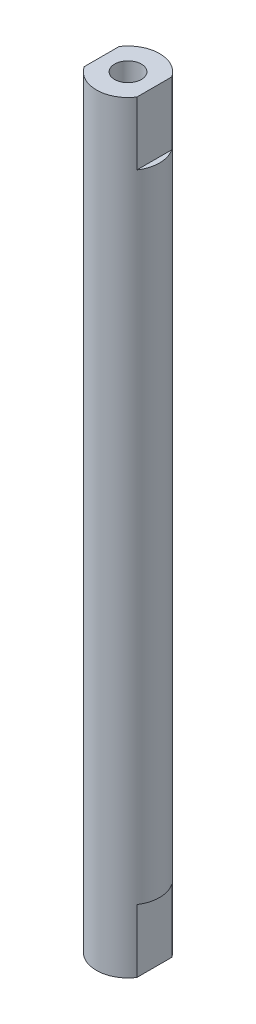
ISO-10303-21;
HEADER;
FILE_DESCRIPTION(('STEP AP214'),'2;1');
FILE_NAME('part.step','',(''),(''),'','','');
FILE_SCHEMA(('AUTOMOTIVE_DESIGN { 1 0 10303 214 1 1 1 1 }'));
ENDSEC;
DATA;
#1=APPLICATION_CONTEXT('core data for automotive mechanical design processes');
#2=APPLICATION_PROTOCOL_DEFINITION('international standard','automotive_design',2000,#1);
#3=PRODUCT_CONTEXT('',#1,'mechanical');
#4=PRODUCT('Part','Part','',(#3));
#5=PRODUCT_RELATED_PRODUCT_CATEGORY('part','',(#4));
#6=PRODUCT_DEFINITION_FORMATION('','',#4);
#7=PRODUCT_DEFINITION_CONTEXT('part definition',#1,'design');
#8=PRODUCT_DEFINITION('design','',#6,#7);
#9=PRODUCT_DEFINITION_SHAPE('','',#8);
#10=(LENGTH_UNIT() NAMED_UNIT(*) SI_UNIT(.MILLI.,.METRE.));
#11=(NAMED_UNIT(*) PLANE_ANGLE_UNIT() SI_UNIT($,.RADIAN.));
#12=(NAMED_UNIT(*) SI_UNIT($,.STERADIAN.) SOLID_ANGLE_UNIT());
#13=UNCERTAINTY_MEASURE_WITH_UNIT(LENGTH_MEASURE(1.E-05),#10,'distance_accuracy_value','');
#14=(GEOMETRIC_REPRESENTATION_CONTEXT(3) GLOBAL_UNCERTAINTY_ASSIGNED_CONTEXT((#13)) GLOBAL_UNIT_ASSIGNED_CONTEXT((#10,
#11,#12)) REPRESENTATION_CONTEXT('',''));
#15=CARTESIAN_POINT('',(0.,0.,0.));
#16=DIRECTION('',(0.,0.,1.));
#17=DIRECTION('',(1.,0.,0.));
#18=AXIS2_PLACEMENT_3D('',#15,#16,#17);
#19=CARTESIAN_POINT('',(0.,57.5,0.));
#20=DIRECTION('',(0.,1.,0.));
#21=DIRECTION('',(-1.,0.,0.));
#22=AXIS2_PLACEMENT_3D('',#19,#20,#21);
#23=PLANE('',#22);
#24=CARTESIAN_POINT('',(1.5809644186773E-13,57.5,0.));
#25=DIRECTION('',(0.,1.,0.));
#26=DIRECTION('',(0.,0.,1.));
#27=AXIS2_PLACEMENT_3D('',#24,#25,#26);
#28=CIRCLE('',#27,2.01929999999999);
#29=CARTESIAN_POINT('',(1.5809644186773E-13,57.5,2.01929999999999));
#30=VERTEX_POINT('',#29);
#31=EDGE_CURVE('E122',#30,#30,#28,.T.);
#32=ORIENTED_EDGE('',*,*,#31,.F.);
#33=EDGE_LOOP('',(#32));
#34=FACE_BOUND('',#33,.T.);
#35=DIRECTION('',(0.,0.,1.));
#36=VECTOR('',#35,1.);
#37=CARTESIAN_POINT('',(3.96875000000008,57.5,2.63257092734472));
#38=LINE('',#37,#36);
#39=CARTESIAN_POINT('',(3.96875000000008,57.5,-2.63257092734472));
#40=VERTEX_POINT('',#39);
#41=CARTESIAN_POINT('',(3.96875000000008,57.5,2.63257092734472));
#42=VERTEX_POINT('',#41);
#43=EDGE_CURVE('E141',#40,#42,#38,.T.);
#44=ORIENTED_EDGE('',*,*,#43,.F.);
#45=CARTESIAN_POINT('',(1.5809644186773E-13,57.5,0.));
#46=DIRECTION('',(0.,-1.,0.));
#47=DIRECTION('',(1.,0.,0.));
#48=AXIS2_PLACEMENT_3D('',#45,#46,#47);
#49=CIRCLE('',#48,4.76250000000014);
#50=CARTESIAN_POINT('',(-3.96874999999992,57.5,-2.63257092734472));
#51=VERTEX_POINT('',#50);
#52=EDGE_CURVE('E50',#51,#40,#49,.T.);
#53=ORIENTED_EDGE('',*,*,#52,.F.);
#54=DIRECTION('',(0.,0.,-1.));
#55=VECTOR('',#54,1.);
#56=CARTESIAN_POINT('',(-3.96874999999992,57.5,2.63257092734472));
#57=LINE('',#56,#55);
#58=CARTESIAN_POINT('',(-3.96874999999992,57.5,2.63257092734472));
#59=VERTEX_POINT('',#58);
#60=EDGE_CURVE('E137',#59,#51,#57,.T.);
#61=ORIENTED_EDGE('',*,*,#60,.F.);
#62=EDGE_CURVE('E11',#42,#59,#49,.T.);
#63=ORIENTED_EDGE('',*,*,#62,.F.);
#64=EDGE_LOOP('',(#44,#53,#61,#63));
#65=FACE_BOUND('',#64,.T.);
#66=ADVANCED_FACE('F42',(#34,#65),#23,.T.);
#67=CARTESIAN_POINT('',(0.,-57.5,0.));
#68=DIRECTION('',(0.,-1.,0.));
#69=DIRECTION('',(1.,0.,0.));
#70=AXIS2_PLACEMENT_3D('',#67,#68,#69);
#71=CYLINDRICAL_SURFACE('',#70,4.76250000000007);
#72=ORIENTED_EDGE('',*,*,#52,.T.);
#73=DIRECTION('',(0.,1.,0.));
#74=VECTOR('',#73,1.);
#75=CARTESIAN_POINT('',(3.96875000000008,47.975,-2.63257092734472));
#76=LINE('',#75,#74);
#77=CARTESIAN_POINT('',(3.96875000000008,47.975,-2.63257092734472));
#78=VERTEX_POINT('',#77);
#79=EDGE_CURVE('E144',#78,#40,#76,.T.);
#80=ORIENTED_EDGE('',*,*,#79,.F.);
#81=CARTESIAN_POINT('',(0.,47.975,0.));
#82=DIRECTION('',(0.,1.,0.));
#83=DIRECTION('',(0.,0.,-1.));
#84=AXIS2_PLACEMENT_3D('',#81,#82,#83);
#85=CIRCLE('',#84,4.76250000000007);
#86=CARTESIAN_POINT('',(3.96875000000013,47.975,2.63257092734475));
#87=VERTEX_POINT('',#86);
#88=EDGE_CURVE('E138',#87,#78,#85,.T.);
#89=ORIENTED_EDGE('',*,*,#88,.F.);
#90=DIRECTION('',(0.,1.,0.));
#91=VECTOR('',#90,1.);
#92=CARTESIAN_POINT('',(3.96875000000008,47.975,2.63257092734472));
#93=LINE('',#92,#91);
#94=EDGE_CURVE('E148',#87,#42,#93,.T.);
#95=ORIENTED_EDGE('',*,*,#94,.T.);
#96=ORIENTED_EDGE('',*,*,#62,.T.);
#97=DIRECTION('',(0.,1.,0.));
#98=VECTOR('',#97,1.);
#99=CARTESIAN_POINT('',(-3.96874999999992,47.975,2.63257092734472));
#100=LINE('',#99,#98);
#101=CARTESIAN_POINT('',(-3.96874999999992,47.975,2.63257092734472));
#102=VERTEX_POINT('',#101);
#103=EDGE_CURVE('E160',#102,#59,#100,.T.);
#104=ORIENTED_EDGE('',*,*,#103,.F.);
#105=CARTESIAN_POINT('',(0.,47.975,0.));
#106=DIRECTION('',(0.,1.,0.));
#107=DIRECTION('',(0.,0.,1.));
#108=AXIS2_PLACEMENT_3D('',#105,#106,#107);
#109=CIRCLE('',#108,4.76250000000007);
#110=CARTESIAN_POINT('',(-3.96874999999988,47.975,-2.63257092734469));
#111=VERTEX_POINT('',#110);
#112=EDGE_CURVE('E155',#111,#102,#109,.T.);
#113=ORIENTED_EDGE('',*,*,#112,.F.);
#114=DIRECTION('',(0.,1.,0.));
#115=VECTOR('',#114,1.);
#116=CARTESIAN_POINT('',(-3.96874999999992,47.975,-2.63257092734472));
#117=LINE('',#116,#115);
#118=EDGE_CURVE('E147',#111,#51,#117,.T.);
#119=ORIENTED_EDGE('',*,*,#118,.T.);
#120=EDGE_LOOP('',(#72,#80,#89,#95,#96,#104,#113,#119));
#121=FACE_BOUND('',#120,.T.);
#122=CARTESIAN_POINT('',(0.,-47.975,0.));
#123=DIRECTION('',(0.,-1.,0.));
#124=DIRECTION('',(0.,0.,1.));
#125=AXIS2_PLACEMENT_3D('',#122,#123,#124);
#126=CIRCLE('',#125,4.7625);
#127=CARTESIAN_POINT('',(3.96874999999992,-47.975,-2.6325709273446));
#128=VERTEX_POINT('',#127);
#129=CARTESIAN_POINT('',(3.96874999999992,-47.975,2.6325709273446));
#130=VERTEX_POINT('',#129);
#131=EDGE_CURVE('E168',#128,#130,#126,.T.);
#132=ORIENTED_EDGE('',*,*,#131,.F.);
#133=DIRECTION('',(0.,-1.,0.));
#134=VECTOR('',#133,1.);
#135=CARTESIAN_POINT('',(3.96874999999992,-47.975,-2.6325709273446));
#136=LINE('',#135,#134);
#137=CARTESIAN_POINT('',(3.96874999999992,-57.5,-2.6325709273446));
#138=VERTEX_POINT('',#137);
#139=EDGE_CURVE('E180',#128,#138,#136,.T.);
#140=ORIENTED_EDGE('',*,*,#139,.T.);
#141=CARTESIAN_POINT('',(0.,-57.5,0.));
#142=DIRECTION('',(0.,-1.,0.));
#143=DIRECTION('',(1.,0.,0.));
#144=AXIS2_PLACEMENT_3D('',#141,#142,#143);
#145=CIRCLE('',#144,4.7625);
#146=CARTESIAN_POINT('',(-3.96875000000008,-57.5,-2.63257092734448));
#147=VERTEX_POINT('',#146);
#148=EDGE_CURVE('E184',#147,#138,#145,.T.);
#149=ORIENTED_EDGE('',*,*,#148,.F.);
#150=DIRECTION('',(0.,-1.,0.));
#151=VECTOR('',#150,1.);
#152=CARTESIAN_POINT('',(-3.96875000000008,-47.975,-2.6325709273446));
#153=LINE('',#152,#151);
#154=CARTESIAN_POINT('',(-3.96875000000008,-47.975,-2.6325709273446));
#155=VERTEX_POINT('',#154);
#156=EDGE_CURVE('E194',#155,#147,#153,.T.);
#157=ORIENTED_EDGE('',*,*,#156,.F.);
#158=CARTESIAN_POINT('',(0.,-47.975,0.));
#159=DIRECTION('',(0.,-1.,0.));
#160=DIRECTION('',(0.,0.,-1.));
#161=AXIS2_PLACEMENT_3D('',#158,#159,#160);
#162=CIRCLE('',#161,4.7625);
#163=CARTESIAN_POINT('',(-3.96875000000008,-47.975,2.6325709273446));
#164=VERTEX_POINT('',#163);
#165=EDGE_CURVE('E187',#164,#155,#162,.T.);
#166=ORIENTED_EDGE('',*,*,#165,.F.);
#167=DIRECTION('',(0.,-1.,0.));
#168=VECTOR('',#167,1.);
#169=CARTESIAN_POINT('',(-3.96875000000008,-47.975,2.6325709273446));
#170=LINE('',#169,#168);
#171=CARTESIAN_POINT('',(-3.96875000000008,-57.5,2.6325709273446));
#172=VERTEX_POINT('',#171);
#173=EDGE_CURVE('E179',#164,#172,#170,.T.);
#174=ORIENTED_EDGE('',*,*,#173,.T.);
#175=CARTESIAN_POINT('',(3.96874999999992,-57.5,2.63257092734472));
#176=VERTEX_POINT('',#175);
#177=EDGE_CURVE('E201',#176,#172,#145,.T.);
#178=ORIENTED_EDGE('',*,*,#177,.F.);
#179=DIRECTION('',(0.,-1.,0.));
#180=VECTOR('',#179,1.);
#181=CARTESIAN_POINT('',(3.96874999999992,-47.975,2.6325709273446));
#182=LINE('',#181,#180);
#183=EDGE_CURVE('E176',#130,#176,#182,.T.);
#184=ORIENTED_EDGE('',*,*,#183,.F.);
#185=EDGE_LOOP('',(#132,#140,#149,#157,#166,#174,#178,#184));
#186=FACE_BOUND('',#185,.T.);
#187=ADVANCED_FACE('F219',(#121,#186),#71,.T.);
#188=CARTESIAN_POINT('',(0.,-57.5,0.));
#189=DIRECTION('',(0.,-1.,0.));
#190=DIRECTION('',(1.,0.,0.));
#191=AXIS2_PLACEMENT_3D('',#188,#189,#190);
#192=PLANE('',#191);
#193=CARTESIAN_POINT('',(1.5809644186773E-13,-57.5,0.));
#194=DIRECTION('',(0.,-1.,0.));
#195=DIRECTION('',(0.,0.,-1.));
#196=AXIS2_PLACEMENT_3D('',#193,#194,#195);
#197=CIRCLE('',#196,2.01929999999999);
#198=CARTESIAN_POINT('',(1.5809644186773E-13,-57.5,-2.01929999999999));
#199=VERTEX_POINT('',#198);
#200=EDGE_CURVE('E123',#199,#199,#197,.T.);
#201=ORIENTED_EDGE('',*,*,#200,.F.);
#202=EDGE_LOOP('',(#201));
#203=FACE_BOUND('',#202,.T.);
#204=DIRECTION('',(0.,0.,-1.));
#205=VECTOR('',#204,1.);
#206=CARTESIAN_POINT('',(3.96874999999992,-57.5,-2.6325709273446));
#207=LINE('',#206,#205);
#208=EDGE_CURVE('E172',#176,#138,#207,.T.);
#209=ORIENTED_EDGE('',*,*,#208,.F.);
#210=ORIENTED_EDGE('',*,*,#177,.T.);
#211=DIRECTION('',(0.,0.,1.));
#212=VECTOR('',#211,1.);
#213=CARTESIAN_POINT('',(-3.96875000000008,-57.5,-2.6325709273446));
#214=LINE('',#213,#212);
#215=EDGE_CURVE('E152',#147,#172,#214,.T.);
#216=ORIENTED_EDGE('',*,*,#215,.F.);
#217=ORIENTED_EDGE('',*,*,#148,.T.);
#218=EDGE_LOOP('',(#209,#210,#216,#217));
#219=FACE_BOUND('',#218,.T.);
#220=ADVANCED_FACE('F215',(#203,#219),#192,.T.);
#221=CARTESIAN_POINT('',(-3.96875000000008,-47.975,-2.6325709273446));
#222=DIRECTION('',(1.,0.,0.));
#223=DIRECTION('',(0.,0.,-1.));
#224=AXIS2_PLACEMENT_3D('',#221,#222,#223);
#225=PLANE('',#224);
#226=ORIENTED_EDGE('',*,*,#215,.T.);
#227=ORIENTED_EDGE('',*,*,#173,.F.);
#228=DIRECTION('',(0.,0.,1.));
#229=VECTOR('',#228,1.);
#230=CARTESIAN_POINT('',(-3.96875000000008,-47.975,-2.6325709273446));
#231=LINE('',#230,#229);
#232=EDGE_CURVE('E190',#155,#164,#231,.T.);
#233=ORIENTED_EDGE('',*,*,#232,.F.);
#234=ORIENTED_EDGE('',*,*,#156,.T.);
#235=EDGE_LOOP('',(#226,#227,#233,#234));
#236=FACE_BOUND('',#235,.T.);
#237=ADVANCED_FACE('F281',(#236),#225,.F.);
#238=CARTESIAN_POINT('',(0.,-47.975,0.));
#239=DIRECTION('',(0.,-1.,0.));
#240=DIRECTION('',(0.,0.,-1.));
#241=AXIS2_PLACEMENT_3D('',#238,#239,#240);
#242=PLANE('',#241);
#243=ORIENTED_EDGE('',*,*,#165,.T.);
#244=ORIENTED_EDGE('',*,*,#232,.T.);
#245=EDGE_LOOP('',(#243,#244));
#246=FACE_BOUND('',#245,.T.);
#247=ADVANCED_FACE('F237',(#246),#242,.T.);
#248=CARTESIAN_POINT('',(3.96874999999992,-47.975,-2.6325709273446));
#249=DIRECTION('',(-1.,0.,0.));
#250=DIRECTION('',(0.,0.,1.));
#251=AXIS2_PLACEMENT_3D('',#248,#249,#250);
#252=PLANE('',#251);
#253=ORIENTED_EDGE('',*,*,#208,.T.);
#254=ORIENTED_EDGE('',*,*,#139,.F.);
#255=DIRECTION('',(0.,0.,-1.));
#256=VECTOR('',#255,1.);
#257=CARTESIAN_POINT('',(3.96874999999992,-47.975,-2.6325709273446));
#258=LINE('',#257,#256);
#259=EDGE_CURVE('E171',#130,#128,#258,.T.);
#260=ORIENTED_EDGE('',*,*,#259,.F.);
#261=ORIENTED_EDGE('',*,*,#183,.T.);
#262=EDGE_LOOP('',(#253,#254,#260,#261));
#263=FACE_BOUND('',#262,.T.);
#264=ADVANCED_FACE('F224',(#263),#252,.F.);
#265=CARTESIAN_POINT('',(0.,-47.975,0.));
#266=DIRECTION('',(0.,1.,0.));
#267=DIRECTION('',(0.,0.,1.));
#268=AXIS2_PLACEMENT_3D('',#265,#266,#267);
#269=PLANE('',#268);
#270=ORIENTED_EDGE('',*,*,#131,.T.);
#271=ORIENTED_EDGE('',*,*,#259,.T.);
#272=EDGE_LOOP('',(#270,#271));
#273=FACE_BOUND('',#272,.T.);
#274=ADVANCED_FACE('F226',(#273),#269,.F.);
#275=CARTESIAN_POINT('',(-3.96874999999992,47.975,2.63257092734472));
#276=DIRECTION('',(1.,0.,0.));
#277=DIRECTION('',(0.,0.,-1.));
#278=AXIS2_PLACEMENT_3D('',#275,#276,#277);
#279=PLANE('',#278);
#280=ORIENTED_EDGE('',*,*,#60,.T.);
#281=ORIENTED_EDGE('',*,*,#118,.F.);
#282=DIRECTION('',(0.,0.,-1.));
#283=VECTOR('',#282,1.);
#284=CARTESIAN_POINT('',(-3.96874999999992,47.975,2.63257092734472));
#285=LINE('',#284,#283);
#286=EDGE_CURVE('E63',#102,#111,#285,.T.);
#287=ORIENTED_EDGE('',*,*,#286,.F.);
#288=ORIENTED_EDGE('',*,*,#103,.T.);
#289=EDGE_LOOP('',(#280,#281,#287,#288));
#290=FACE_BOUND('',#289,.T.);
#291=ADVANCED_FACE('F228',(#290),#279,.F.);
#292=CARTESIAN_POINT('',(0.,47.975,0.));
#293=DIRECTION('',(0.,1.,0.));
#294=DIRECTION('',(0.,0.,1.));
#295=AXIS2_PLACEMENT_3D('',#292,#293,#294);
#296=PLANE('',#295);
#297=ORIENTED_EDGE('',*,*,#112,.T.);
#298=ORIENTED_EDGE('',*,*,#286,.T.);
#299=EDGE_LOOP('',(#297,#298));
#300=FACE_BOUND('',#299,.T.);
#301=ADVANCED_FACE('F234',(#300),#296,.T.);
#302=CARTESIAN_POINT('',(3.96875000000008,47.975,2.63257092734472));
#303=DIRECTION('',(-1.,0.,0.));
#304=DIRECTION('',(0.,0.,1.));
#305=AXIS2_PLACEMENT_3D('',#302,#303,#304);
#306=PLANE('',#305);
#307=ORIENTED_EDGE('',*,*,#43,.T.);
#308=ORIENTED_EDGE('',*,*,#94,.F.);
#309=DIRECTION('',(0.,0.,1.));
#310=VECTOR('',#309,1.);
#311=CARTESIAN_POINT('',(3.96875000000008,47.975,2.63257092734472));
#312=LINE('',#311,#310);
#313=EDGE_CURVE('E56',#78,#87,#312,.T.);
#314=ORIENTED_EDGE('',*,*,#313,.F.);
#315=ORIENTED_EDGE('',*,*,#79,.T.);
#316=EDGE_LOOP('',(#307,#308,#314,#315));
#317=FACE_BOUND('',#316,.T.);
#318=ADVANCED_FACE('F256',(#317),#306,.F.);
#319=CARTESIAN_POINT('',(0.,47.975,0.));
#320=DIRECTION('',(0.,-1.,0.));
#321=DIRECTION('',(0.,0.,-1.));
#322=AXIS2_PLACEMENT_3D('',#319,#320,#321);
#323=PLANE('',#322);
#324=ORIENTED_EDGE('',*,*,#88,.T.);
#325=ORIENTED_EDGE('',*,*,#313,.T.);
#326=EDGE_LOOP('',(#324,#325));
#327=FACE_BOUND('',#326,.T.);
#328=ADVANCED_FACE('F258',(#327),#323,.F.);
#329=CARTESIAN_POINT('',(1.5809644186773E-13,41.498,0.));
#330=DIRECTION('',(0.,1.,0.));
#331=DIRECTION('',(0.,0.,1.));
#332=AXIS2_PLACEMENT_3D('',#329,#330,#331);
#333=CONICAL_SURFACE('',#332,2.0193,1.02974425867665);
#334=CARTESIAN_POINT('',(1.53879905087958E-13,40.2846821519976,0.));
#335=VERTEX_POINT('',#334);
#336=VERTEX_LOOP('',#335);
#337=FACE_BOUND('',#336,.T.);
#338=CARTESIAN_POINT('',(1.5809644186773E-13,41.498,0.));
#339=DIRECTION('',(0.,1.,0.));
#340=DIRECTION('',(0.,0.,1.));
#341=AXIS2_PLACEMENT_3D('',#338,#339,#340);
#342=CIRCLE('',#341,2.0193);
#343=CARTESIAN_POINT('',(1.5809644186773E-13,41.498,2.0193));
#344=VERTEX_POINT('',#343);
#345=EDGE_CURVE('E129',#344,#344,#342,.T.);
#346=ORIENTED_EDGE('',*,*,#345,.T.);
#347=EDGE_LOOP('',(#346));
#348=FACE_BOUND('',#347,.T.);
#349=ADVANCED_FACE('F264',(#337,#348),#333,.F.);
#350=CARTESIAN_POINT('',(1.5809644186773E-13,57.5,0.));
#351=DIRECTION('',(0.,1.,0.));
#352=DIRECTION('',(0.,0.,1.));
#353=AXIS2_PLACEMENT_3D('',#350,#351,#352);
#354=CYLINDRICAL_SURFACE('',#353,2.01929999999999);
#355=ORIENTED_EDGE('',*,*,#345,.F.);
#356=EDGE_LOOP('',(#355));
#357=FACE_BOUND('',#356,.T.);
#358=ORIENTED_EDGE('',*,*,#31,.T.);
#359=EDGE_LOOP('',(#358));
#360=FACE_BOUND('',#359,.T.);
#361=ADVANCED_FACE('F115',(#357,#360),#354,.F.);
#362=CARTESIAN_POINT('',(1.5809644186773E-13,-41.498,0.));
#363=DIRECTION('',(0.,-1.,0.));
#364=DIRECTION('',(0.,0.,-1.));
#365=AXIS2_PLACEMENT_3D('',#362,#363,#364);
#366=CONICAL_SURFACE('',#365,2.0193,1.02974425867665);
#367=CARTESIAN_POINT('',(1.53879905087958E-13,-40.2846821519977,0.));
#368=VERTEX_POINT('',#367);
#369=VERTEX_LOOP('',#368);
#370=FACE_BOUND('',#369,.T.);
#371=CARTESIAN_POINT('',(1.5809644186773E-13,-41.498,0.));
#372=DIRECTION('',(0.,-1.,0.));
#373=DIRECTION('',(0.,0.,-1.));
#374=AXIS2_PLACEMENT_3D('',#371,#372,#373);
#375=CIRCLE('',#374,2.0193);
#376=CARTESIAN_POINT('',(1.5809644186773E-13,-41.498,-2.0193));
#377=VERTEX_POINT('',#376);
#378=EDGE_CURVE('E119',#377,#377,#375,.T.);
#379=ORIENTED_EDGE('',*,*,#378,.T.);
#380=EDGE_LOOP('',(#379));
#381=FACE_BOUND('',#380,.T.);
#382=ADVANCED_FACE('F111',(#370,#381),#366,.F.);
#383=CARTESIAN_POINT('',(1.5809644186773E-13,-57.5,0.));
#384=DIRECTION('',(0.,-1.,0.));
#385=DIRECTION('',(0.,0.,-1.));
#386=AXIS2_PLACEMENT_3D('',#383,#384,#385);
#387=CYLINDRICAL_SURFACE('',#386,2.01929999999999);
#388=ORIENTED_EDGE('',*,*,#378,.F.);
#389=EDGE_LOOP('',(#388));
#390=FACE_BOUND('',#389,.T.);
#391=ORIENTED_EDGE('',*,*,#200,.T.);
#392=EDGE_LOOP('',(#391));
#393=FACE_BOUND('',#392,.T.);
#394=ADVANCED_FACE('F114',(#390,#393),#387,.F.);
#395=CLOSED_SHELL('',(#66,#187,#220,#237,#247,#264,#274,#291,#301,#318,#328,#349,#361,#382,#394));
#396=MANIFOLD_SOLID_BREP('B2',#395);
#397=ADVANCED_BREP_SHAPE_REPRESENTATION('',(#18,#396),#14);
#398=SHAPE_DEFINITION_REPRESENTATION(#9,#397);
ENDSEC;
END-ISO-10303-21;
